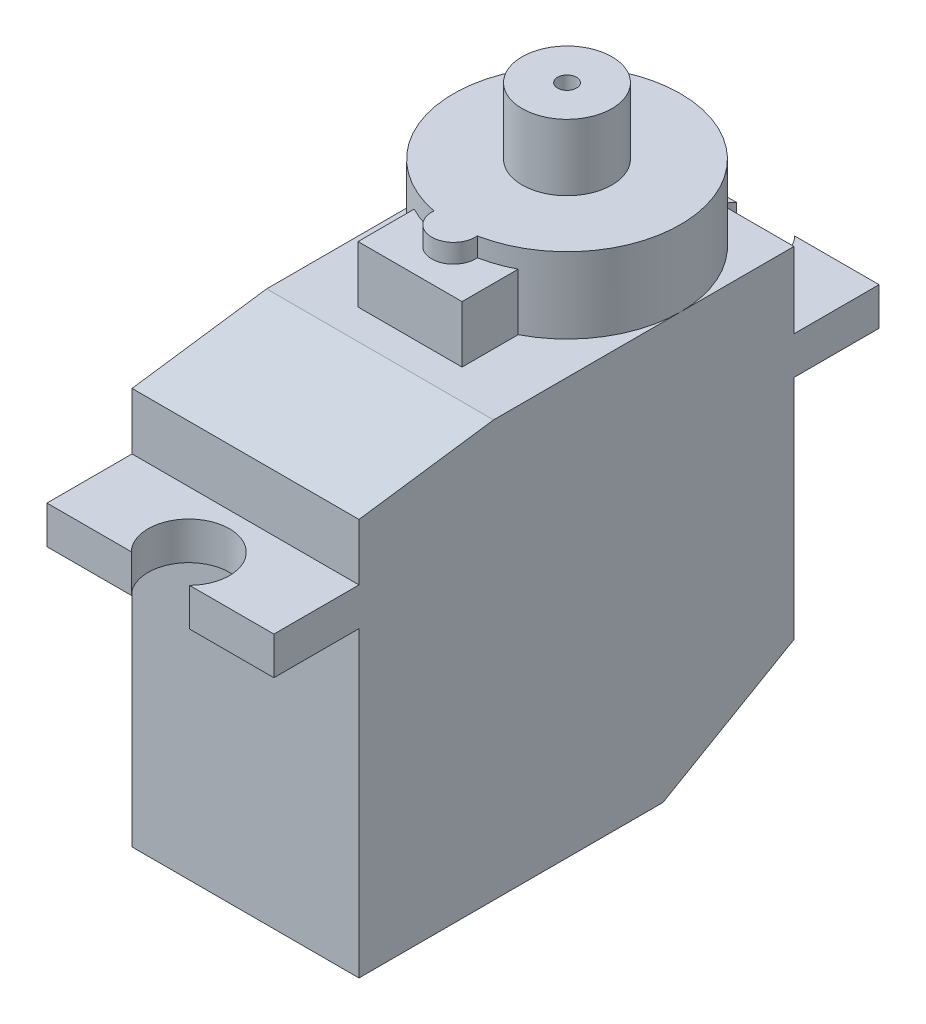
ISO-10303-21;
HEADER;
FILE_DESCRIPTION(('STEP AP214'),'2;1');
FILE_NAME('part.step','',(''),(''),'','','');
FILE_SCHEMA(('AUTOMOTIVE_DESIGN { 1 0 10303 214 1 1 1 1 }'));
ENDSEC;
DATA;
#1=APPLICATION_CONTEXT('core data for automotive mechanical design processes');
#2=APPLICATION_PROTOCOL_DEFINITION('international standard','automotive_design',2000,#1);
#3=PRODUCT_CONTEXT('',#1,'mechanical');
#4=PRODUCT('Part','Part','',(#3));
#5=PRODUCT_RELATED_PRODUCT_CATEGORY('part','',(#4));
#6=PRODUCT_DEFINITION_FORMATION('','',#4);
#7=PRODUCT_DEFINITION_CONTEXT('part definition',#1,'design');
#8=PRODUCT_DEFINITION('design','',#6,#7);
#9=PRODUCT_DEFINITION_SHAPE('','',#8);
#10=(LENGTH_UNIT() NAMED_UNIT(*) SI_UNIT(.MILLI.,.METRE.));
#11=(NAMED_UNIT(*) PLANE_ANGLE_UNIT() SI_UNIT($,.RADIAN.));
#12=(NAMED_UNIT(*) SI_UNIT($,.STERADIAN.) SOLID_ANGLE_UNIT());
#13=UNCERTAINTY_MEASURE_WITH_UNIT(LENGTH_MEASURE(1.E-05),#10,'distance_accuracy_value','');
#14=(GEOMETRIC_REPRESENTATION_CONTEXT(3) GLOBAL_UNCERTAINTY_ASSIGNED_CONTEXT((#13)) GLOBAL_UNIT_ASSIGNED_CONTEXT((#10,
#11,#12)) REPRESENTATION_CONTEXT('',''));
#15=CARTESIAN_POINT('',(0.,0.,0.));
#16=DIRECTION('',(0.,0.,1.));
#17=DIRECTION('',(1.,0.,0.));
#18=AXIS2_PLACEMENT_3D('',#15,#16,#17);
#19=CARTESIAN_POINT('',(0.,26.,0.));
#20=DIRECTION('',(0.,1.,0.));
#21=DIRECTION('',(0.,0.,1.));
#22=AXIS2_PLACEMENT_3D('',#19,#20,#21);
#23=PLANE('',#22);
#24=CARTESIAN_POINT('',(0.,26.,0.));
#25=DIRECTION('',(0.,1.,0.));
#26=DIRECTION('',(0.,0.,1.));
#27=AXIS2_PLACEMENT_3D('',#24,#25,#26);
#28=CIRCLE('',#27,6.);
#29=CARTESIAN_POINT('',(1.14470700323877,26.,5.88979166666666));
#30=VERTEX_POINT('',#29);
#31=CARTESIAN_POINT('',(-1.14470700323877,26.,5.88979166666666));
#32=VERTEX_POINT('',#31);
#33=EDGE_CURVE('E218',#30,#32,#28,.T.);
#34=ORIENTED_EDGE('',*,*,#33,.T.);
#35=CARTESIAN_POINT('',(0.,26.,6.));
#36=DIRECTION('',(0.,1.,0.));
#37=DIRECTION('',(0.,0.,1.));
#38=AXIS2_PLACEMENT_3D('',#35,#36,#37);
#39=CIRCLE('',#38,1.15);
#40=EDGE_CURVE('E223',#32,#30,#39,.T.);
#41=ORIENTED_EDGE('',*,*,#40,.T.);
#42=EDGE_LOOP('',(#34,#41));
#43=FACE_BOUND('',#42,.T.);
#44=CARTESIAN_POINT('',(0.,26.,0.));
#45=DIRECTION('',(0.,1.,0.));
#46=DIRECTION('',(0.,0.,1.));
#47=AXIS2_PLACEMENT_3D('',#44,#45,#46);
#48=CIRCLE('',#47,2.375);
#49=CARTESIAN_POINT('',(0.,26.,2.375));
#50=VERTEX_POINT('',#49);
#51=EDGE_CURVE('E345',#50,#50,#48,.T.);
#52=ORIENTED_EDGE('',*,*,#51,.F.);
#53=EDGE_LOOP('',(#52));
#54=FACE_BOUND('',#53,.T.);
#55=ADVANCED_FACE('F34',(#43,#54),#23,.T.);
#56=CARTESIAN_POINT('',(0.,26.,0.));
#57=DIRECTION('',(0.,-1.,0.));
#58=DIRECTION('',(0.,0.,-1.));
#59=AXIS2_PLACEMENT_3D('',#56,#57,#58);
#60=CYLINDRICAL_SURFACE('',#59,6.);
#61=DIRECTION('',(0.,-1.,0.));
#62=VECTOR('',#61,1.);
#63=CARTESIAN_POINT('',(-1.14470700323877,25.5,5.88979166666666));
#64=LINE('',#63,#62);
#65=CARTESIAN_POINT('',(-1.14470700323877,25.,5.88979166666666));
#66=VERTEX_POINT('',#65);
#67=EDGE_CURVE('E222',#32,#66,#64,.T.);
#68=ORIENTED_EDGE('',*,*,#67,.F.);
#69=ORIENTED_EDGE('',*,*,#33,.F.);
#70=DIRECTION('',(0.,-1.,0.));
#71=VECTOR('',#70,1.);
#72=CARTESIAN_POINT('',(1.14470700323877,25.5,5.88979166666666));
#73=LINE('',#72,#71);
#74=CARTESIAN_POINT('',(1.14470700323877,25.,5.88979166666666));
#75=VERTEX_POINT('',#74);
#76=EDGE_CURVE('E215',#75,#30,#73,.F.);
#77=ORIENTED_EDGE('',*,*,#76,.F.);
#78=CARTESIAN_POINT('',(0.,25.,0.));
#79=DIRECTION('',(0.,-1.,0.));
#80=DIRECTION('',(0.,0.,-1.));
#81=AXIS2_PLACEMENT_3D('',#78,#79,#80);
#82=CIRCLE('',#81,6.);
#83=CARTESIAN_POINT('',(2.75,25.,5.33268225192538));
#84=VERTEX_POINT('',#83);
#85=EDGE_CURVE('E201',#84,#75,#82,.T.);
#86=ORIENTED_EDGE('',*,*,#85,.F.);
#87=DIRECTION('',(0.,-1.,0.));
#88=VECTOR('',#87,1.);
#89=CARTESIAN_POINT('',(2.75,26.,5.33268225192538));
#90=LINE('',#89,#88);
#91=CARTESIAN_POINT('',(2.75,22.,5.33268225192538));
#92=VERTEX_POINT('',#91);
#93=EDGE_CURVE('E211',#92,#84,#90,.F.);
#94=ORIENTED_EDGE('',*,*,#93,.F.);
#95=CARTESIAN_POINT('',(0.,22.,0.));
#96=DIRECTION('',(0.,1.,0.));
#97=DIRECTION('',(0.,0.,1.));
#98=AXIS2_PLACEMENT_3D('',#95,#96,#97);
#99=CIRCLE('',#98,6.);
#100=CARTESIAN_POINT('',(6.,22.,0.));
#101=VERTEX_POINT('',#100);
#102=EDGE_CURVE('E303',#92,#101,#99,.T.);
#103=ORIENTED_EDGE('',*,*,#102,.T.);
#104=CARTESIAN_POINT('',(0.,22.,-6.));
#105=VERTEX_POINT('',#104);
#106=EDGE_CURVE('E314',#101,#105,#99,.T.);
#107=ORIENTED_EDGE('',*,*,#106,.T.);
#108=CARTESIAN_POINT('',(-6.,22.,0.));
#109=VERTEX_POINT('',#108);
#110=EDGE_CURVE('E313',#105,#109,#99,.T.);
#111=ORIENTED_EDGE('',*,*,#110,.T.);
#112=CARTESIAN_POINT('',(-2.75,22.,5.33268225192538));
#113=VERTEX_POINT('',#112);
#114=EDGE_CURVE('E310',#109,#113,#99,.T.);
#115=ORIENTED_EDGE('',*,*,#114,.T.);
#116=DIRECTION('',(0.,-1.,0.));
#117=VECTOR('',#116,1.);
#118=CARTESIAN_POINT('',(-2.75,26.,5.33268225192538));
#119=LINE('',#118,#117);
#120=CARTESIAN_POINT('',(-2.75,25.,5.33268225192538));
#121=VERTEX_POINT('',#120);
#122=EDGE_CURVE('E228',#121,#113,#119,.T.);
#123=ORIENTED_EDGE('',*,*,#122,.F.);
#124=EDGE_CURVE('E212',#66,#121,#82,.T.);
#125=ORIENTED_EDGE('',*,*,#124,.F.);
#126=EDGE_LOOP('',(#68,#69,#77,#86,#94,#103,#107,#111,#115,#123,#125));
#127=FACE_BOUND('',#126,.T.);
#128=ADVANCED_FACE('F216',(#127),#60,.T.);
#129=CARTESIAN_POINT('',(-2.75,25.,0.));
#130=DIRECTION('',(0.,-1.,0.));
#131=DIRECTION('',(0.,0.,-1.));
#132=AXIS2_PLACEMENT_3D('',#129,#130,#131);
#133=PLANE('',#132);
#134=CARTESIAN_POINT('',(0.,25.,6.));
#135=DIRECTION('',(0.,-1.,0.));
#136=DIRECTION('',(0.,0.,-1.));
#137=AXIS2_PLACEMENT_3D('',#134,#135,#136);
#138=CIRCLE('',#137,1.15);
#139=EDGE_CURVE('E205',#66,#75,#138,.F.);
#140=ORIENTED_EDGE('',*,*,#139,.F.);
#141=ORIENTED_EDGE('',*,*,#124,.T.);
#142=DIRECTION('',(0.,0.,1.));
#143=VECTOR('',#142,1.);
#144=CARTESIAN_POINT('',(-2.75,25.,8.3));
#145=LINE('',#144,#143);
#146=CARTESIAN_POINT('',(-2.75,25.,8.3));
#147=VERTEX_POINT('',#146);
#148=EDGE_CURVE('E332',#121,#147,#145,.T.);
#149=ORIENTED_EDGE('',*,*,#148,.T.);
#150=DIRECTION('',(1.,0.,0.));
#151=VECTOR('',#150,1.);
#152=CARTESIAN_POINT('',(-2.75,25.,8.3));
#153=LINE('',#152,#151);
#154=CARTESIAN_POINT('',(2.75,25.,8.3));
#155=VERTEX_POINT('',#154);
#156=EDGE_CURVE('E339',#147,#155,#153,.T.);
#157=ORIENTED_EDGE('',*,*,#156,.T.);
#158=DIRECTION('',(0.,0.,-1.));
#159=VECTOR('',#158,1.);
#160=CARTESIAN_POINT('',(2.75,25.,8.3));
#161=LINE('',#160,#159);
#162=EDGE_CURVE('E208',#155,#84,#161,.T.);
#163=ORIENTED_EDGE('',*,*,#162,.T.);
#164=ORIENTED_EDGE('',*,*,#85,.T.);
#165=EDGE_LOOP('',(#140,#141,#149,#157,#163,#164));
#166=FACE_BOUND('',#165,.T.);
#167=ADVANCED_FACE('F203',(#166),#133,.F.);
#168=CARTESIAN_POINT('',(-6.,22.,17.));
#169=DIRECTION('',(0.,1.,0.));
#170=DIRECTION('',(0.,0.,1.));
#171=AXIS2_PLACEMENT_3D('',#168,#169,#170);
#172=PLANE('',#171);
#173=DIRECTION('',(0.,0.,1.));
#174=VECTOR('',#173,1.);
#175=CARTESIAN_POINT('',(-6.,22.,-6.));
#176=LINE('',#175,#174);
#177=CARTESIAN_POINT('',(-6.,22.,9.88463027761568));
#178=VERTEX_POINT('',#177);
#179=EDGE_CURVE('E649',#109,#178,#176,.T.);
#180=ORIENTED_EDGE('',*,*,#179,.T.);
#181=DIRECTION('',(1.,0.,0.));
#182=VECTOR('',#181,1.);
#183=CARTESIAN_POINT('',(6.,22.,9.88463027761579));
#184=LINE('',#183,#182);
#185=CARTESIAN_POINT('',(6.,22.,9.88463027761568));
#186=VERTEX_POINT('',#185);
#187=EDGE_CURVE('E231',#178,#186,#184,.T.);
#188=ORIENTED_EDGE('',*,*,#187,.T.);
#189=DIRECTION('',(0.,0.,-1.));
#190=VECTOR('',#189,1.);
#191=CARTESIAN_POINT('',(6.,22.,-6.));
#192=LINE('',#191,#190);
#193=EDGE_CURVE('E309',#186,#101,#192,.T.);
#194=ORIENTED_EDGE('',*,*,#193,.T.);
#195=ORIENTED_EDGE('',*,*,#102,.F.);
#196=DIRECTION('',(0.,0.,-1.));
#197=VECTOR('',#196,1.);
#198=CARTESIAN_POINT('',(2.75,22.,8.3));
#199=LINE('',#198,#197);
#200=CARTESIAN_POINT('',(2.75,22.,8.3));
#201=VERTEX_POINT('',#200);
#202=EDGE_CURVE('E299',#201,#92,#199,.T.);
#203=ORIENTED_EDGE('',*,*,#202,.F.);
#204=DIRECTION('',(1.,0.,0.));
#205=VECTOR('',#204,1.);
#206=CARTESIAN_POINT('',(-2.75,22.,8.3));
#207=LINE('',#206,#205);
#208=CARTESIAN_POINT('',(-2.75,22.,8.3));
#209=VERTEX_POINT('',#208);
#210=EDGE_CURVE('E333',#209,#201,#207,.T.);
#211=ORIENTED_EDGE('',*,*,#210,.F.);
#212=DIRECTION('',(0.,0.,1.));
#213=VECTOR('',#212,1.);
#214=CARTESIAN_POINT('',(-2.75,22.,8.3));
#215=LINE('',#214,#213);
#216=EDGE_CURVE('E335',#113,#209,#215,.T.);
#217=ORIENTED_EDGE('',*,*,#216,.F.);
#218=ORIENTED_EDGE('',*,*,#114,.F.);
#219=EDGE_LOOP('',(#180,#188,#194,#195,#203,#211,#217,#218));
#220=FACE_BOUND('',#219,.T.);
#221=ADVANCED_FACE('F307',(#220),#172,.T.);
#222=ORIENTED_EDGE('',*,*,#106,.F.);
#223=CARTESIAN_POINT('',(6.,22.,-6.));
#224=VERTEX_POINT('',#223);
#225=EDGE_CURVE('E651',#101,#224,#192,.T.);
#226=ORIENTED_EDGE('',*,*,#225,.T.);
#227=DIRECTION('',(-1.,0.,0.));
#228=VECTOR('',#227,1.);
#229=CARTESIAN_POINT('',(-6.,22.,-6.));
#230=LINE('',#229,#228);
#231=EDGE_CURVE('E654',#224,#105,#230,.T.);
#232=ORIENTED_EDGE('',*,*,#231,.T.);
#233=EDGE_LOOP('',(#222,#226,#232));
#234=FACE_BOUND('',#233,.T.);
#235=ADVANCED_FACE('F483',(#234),#172,.T.);
#236=ORIENTED_EDGE('',*,*,#110,.F.);
#237=CARTESIAN_POINT('',(-6.,22.,-6.));
#238=VERTEX_POINT('',#237);
#239=EDGE_CURVE('E652',#105,#238,#230,.T.);
#240=ORIENTED_EDGE('',*,*,#239,.T.);
#241=EDGE_CURVE('E656',#238,#109,#176,.T.);
#242=ORIENTED_EDGE('',*,*,#241,.T.);
#243=EDGE_LOOP('',(#236,#240,#242));
#244=FACE_BOUND('',#243,.T.);
#245=ADVANCED_FACE('F478',(#244),#172,.T.);
#246=CARTESIAN_POINT('',(-6.,22.,17.));
#247=DIRECTION('',(0.,0.,-1.));
#248=DIRECTION('',(-1.,0.,0.));
#249=AXIS2_PLACEMENT_3D('',#246,#247,#248);
#250=PLANE('',#249);
#251=DIRECTION('',(0.,-1.,0.));
#252=VECTOR('',#251,1.);
#253=CARTESIAN_POINT('',(6.,22.,17.));
#254=LINE('',#253,#252);
#255=CARTESIAN_POINT('',(6.,21.,17.));
#256=VERTEX_POINT('',#255);
#257=CARTESIAN_POINT('',(6.,18.,17.));
#258=VERTEX_POINT('',#257);
#259=EDGE_CURVE('E239',#256,#258,#254,.T.);
#260=ORIENTED_EDGE('',*,*,#259,.F.);
#261=DIRECTION('',(-1.,0.,0.));
#262=VECTOR('',#261,1.);
#263=CARTESIAN_POINT('',(-6.,21.,17.));
#264=LINE('',#263,#262);
#265=CARTESIAN_POINT('',(-6.,21.,17.));
#266=VERTEX_POINT('',#265);
#267=EDGE_CURVE('E42',#256,#266,#264,.T.);
#268=ORIENTED_EDGE('',*,*,#267,.T.);
#269=DIRECTION('',(0.,-1.,0.));
#270=VECTOR('',#269,1.);
#271=CARTESIAN_POINT('',(-6.,22.,17.));
#272=LINE('',#271,#270);
#273=CARTESIAN_POINT('',(-6.,18.,17.));
#274=VERTEX_POINT('',#273);
#275=EDGE_CURVE('E260',#266,#274,#272,.T.);
#276=ORIENTED_EDGE('',*,*,#275,.T.);
#277=DIRECTION('',(-1.,0.,0.));
#278=VECTOR('',#277,1.);
#279=CARTESIAN_POINT('',(-6.,18.,17.));
#280=LINE('',#279,#278);
#281=EDGE_CURVE('E261',#258,#274,#280,.T.);
#282=ORIENTED_EDGE('',*,*,#281,.F.);
#283=EDGE_LOOP('',(#260,#268,#276,#282));
#284=FACE_BOUND('',#283,.T.);
#285=ADVANCED_FACE('F467',(#284),#250,.F.);
#286=CARTESIAN_POINT('',(-6.,22.,-6.));
#287=DIRECTION('',(0.,0.,1.));
#288=DIRECTION('',(1.,0.,0.));
#289=AXIS2_PLACEMENT_3D('',#286,#287,#288);
#290=PLANE('',#289);
#291=DIRECTION('',(1.,0.,0.));
#292=VECTOR('',#291,1.);
#293=CARTESIAN_POINT('',(-6.,18.,-6.));
#294=LINE('',#293,#292);
#295=CARTESIAN_POINT('',(-6.,18.,-6.));
#296=VERTEX_POINT('',#295);
#297=CARTESIAN_POINT('',(6.,18.,-6.));
#298=VERTEX_POINT('',#297);
#299=EDGE_CURVE('E730',#296,#298,#294,.T.);
#300=ORIENTED_EDGE('',*,*,#299,.F.);
#301=DIRECTION('',(0.,-1.,0.));
#302=VECTOR('',#301,1.);
#303=CARTESIAN_POINT('',(-6.,22.,-6.));
#304=LINE('',#303,#302);
#305=EDGE_CURVE('E676',#238,#296,#304,.T.);
#306=ORIENTED_EDGE('',*,*,#305,.F.);
#307=ORIENTED_EDGE('',*,*,#239,.F.);
#308=ORIENTED_EDGE('',*,*,#231,.F.);
#309=DIRECTION('',(0.,-1.,0.));
#310=VECTOR('',#309,1.);
#311=CARTESIAN_POINT('',(6.,22.,-6.));
#312=LINE('',#311,#310);
#313=EDGE_CURVE('E256',#224,#298,#312,.T.);
#314=ORIENTED_EDGE('',*,*,#313,.T.);
#315=EDGE_LOOP('',(#300,#306,#307,#308,#314));
#316=FACE_BOUND('',#315,.T.);
#317=ADVANCED_FACE('F461',(#316),#290,.F.);
#318=CARTESIAN_POINT('',(-6.,22.,-6.));
#319=DIRECTION('',(1.,0.,0.));
#320=DIRECTION('',(0.,0.,-1.));
#321=AXIS2_PLACEMENT_3D('',#318,#319,#320);
#322=PLANE('',#321);
#323=ORIENTED_EDGE('',*,*,#275,.F.);
#324=DIRECTION('',(0.,0.139173100960066,-0.99026806874157));
#325=VECTOR('',#324,1.);
#326=CARTESIAN_POINT('',(-6.,22.,9.88463027761579));
#327=LINE('',#326,#325);
#328=EDGE_CURVE('E11',#266,#178,#327,.T.);
#329=ORIENTED_EDGE('',*,*,#328,.T.);
#330=ORIENTED_EDGE('',*,*,#179,.F.);
#331=ORIENTED_EDGE('',*,*,#241,.F.);
#332=ORIENTED_EDGE('',*,*,#305,.T.);
#333=DIRECTION('',(0.,0.,1.));
#334=VECTOR('',#333,1.);
#335=CARTESIAN_POINT('',(-6.,18.,-6.));
#336=LINE('',#335,#334);
#337=CARTESIAN_POINT('',(-6.,18.,-10.5));
#338=VERTEX_POINT('',#337);
#339=EDGE_CURVE('E737',#338,#296,#336,.T.);
#340=ORIENTED_EDGE('',*,*,#339,.F.);
#341=DIRECTION('',(0.,-1.,0.));
#342=VECTOR('',#341,1.);
#343=CARTESIAN_POINT('',(-6.,18.,-10.5));
#344=LINE('',#343,#342);
#345=CARTESIAN_POINT('',(-6.,16.,-10.5));
#346=VERTEX_POINT('',#345);
#347=EDGE_CURVE('E740',#338,#346,#344,.T.);
#348=ORIENTED_EDGE('',*,*,#347,.T.);
#349=DIRECTION('',(0.,0.,1.));
#350=VECTOR('',#349,1.);
#351=CARTESIAN_POINT('',(-6.,16.,-6.));
#352=LINE('',#351,#350);
#353=CARTESIAN_POINT('',(-6.,16.,-6.));
#354=VERTEX_POINT('',#353);
#355=EDGE_CURVE('E735',#346,#354,#352,.T.);
#356=ORIENTED_EDGE('',*,*,#355,.T.);
#357=CARTESIAN_POINT('',(-6.,4.00000000000001,-6.));
#358=VERTEX_POINT('',#357);
#359=EDGE_CURVE('E661',#354,#358,#304,.T.);
#360=ORIENTED_EDGE('',*,*,#359,.T.);
#361=DIRECTION('',(0.,0.500000000000001,-0.866025403784438));
#362=VECTOR('',#361,1.);
#363=CARTESIAN_POINT('',(-6.,4.00000000000001,-6.));
#364=LINE('',#363,#362);
#365=CARTESIAN_POINT('',(-6.,0.,0.928203230275506));
#366=VERTEX_POINT('',#365);
#367=EDGE_CURVE('E683',#358,#366,#364,.F.);
#368=ORIENTED_EDGE('',*,*,#367,.T.);
#369=DIRECTION('',(0.,0.,1.));
#370=VECTOR('',#369,1.);
#371=CARTESIAN_POINT('',(-6.,0.,-6.));
#372=LINE('',#371,#370);
#373=CARTESIAN_POINT('',(-6.,0.,17.));
#374=VERTEX_POINT('',#373);
#375=EDGE_CURVE('E662',#366,#374,#372,.T.);
#376=ORIENTED_EDGE('',*,*,#375,.T.);
#377=CARTESIAN_POINT('',(-6.,16.,17.));
#378=VERTEX_POINT('',#377);
#379=EDGE_CURVE('E242',#378,#374,#272,.T.);
#380=ORIENTED_EDGE('',*,*,#379,.F.);
#381=DIRECTION('',(0.,0.,1.));
#382=VECTOR('',#381,1.);
#383=CARTESIAN_POINT('',(-6.,16.,17.));
#384=LINE('',#383,#382);
#385=CARTESIAN_POINT('',(-5.99999999999999,16.,21.5));
#386=VERTEX_POINT('',#385);
#387=EDGE_CURVE('E290',#378,#386,#384,.T.);
#388=ORIENTED_EDGE('',*,*,#387,.T.);
#389=DIRECTION('',(0.,-1.,0.));
#390=VECTOR('',#389,1.);
#391=CARTESIAN_POINT('',(-5.99999999999999,18.,21.5));
#392=LINE('',#391,#390);
#393=CARTESIAN_POINT('',(-5.99999999999999,18.,21.5));
#394=VERTEX_POINT('',#393);
#395=EDGE_CURVE('E721',#394,#386,#392,.T.);
#396=ORIENTED_EDGE('',*,*,#395,.F.);
#397=DIRECTION('',(0.,0.,1.));
#398=VECTOR('',#397,1.);
#399=CARTESIAN_POINT('',(-6.,18.,17.));
#400=LINE('',#399,#398);
#401=EDGE_CURVE('E265',#274,#394,#400,.T.);
#402=ORIENTED_EDGE('',*,*,#401,.F.);
#403=EDGE_LOOP('',(#323,#329,#330,#331,#332,#340,#348,#356,#360,#368,#376,#380,#388,#396,#402));
#404=FACE_BOUND('',#403,.T.);
#405=ADVANCED_FACE('F466',(#404),#322,.F.);
#406=CARTESIAN_POINT('',(6.,16.,17.));
#407=VERTEX_POINT('',#406);
#408=CARTESIAN_POINT('',(6.,0.,17.));
#409=VERTEX_POINT('',#408);
#410=EDGE_CURVE('E243',#407,#409,#254,.T.);
#411=ORIENTED_EDGE('',*,*,#410,.F.);
#412=DIRECTION('',(-1.,0.,0.));
#413=VECTOR('',#412,1.);
#414=CARTESIAN_POINT('',(-6.,16.,17.));
#415=LINE('',#414,#413);
#416=EDGE_CURVE('E287',#407,#378,#415,.T.);
#417=ORIENTED_EDGE('',*,*,#416,.T.);
#418=ORIENTED_EDGE('',*,*,#379,.T.);
#419=DIRECTION('',(1.,0.,0.));
#420=VECTOR('',#419,1.);
#421=CARTESIAN_POINT('',(-6.,0.,17.));
#422=LINE('',#421,#420);
#423=EDGE_CURVE('E665',#374,#409,#422,.T.);
#424=ORIENTED_EDGE('',*,*,#423,.T.);
#425=EDGE_LOOP('',(#411,#417,#418,#424));
#426=FACE_BOUND('',#425,.T.);
#427=ADVANCED_FACE('F613',(#426),#250,.F.);
#428=CARTESIAN_POINT('',(6.,22.,-6.));
#429=DIRECTION('',(-1.,0.,0.));
#430=DIRECTION('',(0.,0.,1.));
#431=AXIS2_PLACEMENT_3D('',#428,#429,#430);
#432=PLANE('',#431);
#433=ORIENTED_EDGE('',*,*,#193,.F.);
#434=DIRECTION('',(0.,-0.139173100960066,0.99026806874157));
#435=VECTOR('',#434,1.);
#436=CARTESIAN_POINT('',(6.,22.,9.88463027761579));
#437=LINE('',#436,#435);
#438=EDGE_CURVE('E56',#186,#256,#437,.T.);
#439=ORIENTED_EDGE('',*,*,#438,.T.);
#440=ORIENTED_EDGE('',*,*,#259,.T.);
#441=DIRECTION('',(0.,0.,-1.));
#442=VECTOR('',#441,1.);
#443=CARTESIAN_POINT('',(6.,18.,17.));
#444=LINE('',#443,#442);
#445=CARTESIAN_POINT('',(6.,18.,21.5));
#446=VERTEX_POINT('',#445);
#447=EDGE_CURVE('E266',#446,#258,#444,.T.);
#448=ORIENTED_EDGE('',*,*,#447,.F.);
#449=DIRECTION('',(0.,-1.,0.));
#450=VECTOR('',#449,1.);
#451=CARTESIAN_POINT('',(6.,18.,21.5));
#452=LINE('',#451,#450);
#453=CARTESIAN_POINT('',(6.,16.,21.5));
#454=VERTEX_POINT('',#453);
#455=EDGE_CURVE('E715',#446,#454,#452,.T.);
#456=ORIENTED_EDGE('',*,*,#455,.T.);
#457=DIRECTION('',(0.,0.,-1.));
#458=VECTOR('',#457,1.);
#459=CARTESIAN_POINT('',(6.,16.,17.));
#460=LINE('',#459,#458);
#461=EDGE_CURVE('E281',#454,#407,#460,.T.);
#462=ORIENTED_EDGE('',*,*,#461,.T.);
#463=ORIENTED_EDGE('',*,*,#410,.T.);
#464=DIRECTION('',(0.,0.,-1.));
#465=VECTOR('',#464,1.);
#466=CARTESIAN_POINT('',(6.,0.,-6.));
#467=LINE('',#466,#465);
#468=CARTESIAN_POINT('',(6.,0.,0.928203230275504));
#469=VERTEX_POINT('',#468);
#470=EDGE_CURVE('E669',#409,#469,#467,.T.);
#471=ORIENTED_EDGE('',*,*,#470,.T.);
#472=DIRECTION('',(0.,-0.500000000000001,0.866025403784438));
#473=VECTOR('',#472,1.);
#474=CARTESIAN_POINT('',(6.,4.00000000000001,-6.));
#475=LINE('',#474,#473);
#476=CARTESIAN_POINT('',(6.,4.00000000000001,-6.));
#477=VERTEX_POINT('',#476);
#478=EDGE_CURVE('E311',#469,#477,#475,.F.);
#479=ORIENTED_EDGE('',*,*,#478,.T.);
#480=CARTESIAN_POINT('',(6.,16.,-6.));
#481=VERTEX_POINT('',#480);
#482=EDGE_CURVE('E679',#481,#477,#312,.T.);
#483=ORIENTED_EDGE('',*,*,#482,.F.);
#484=DIRECTION('',(0.,0.,-1.));
#485=VECTOR('',#484,1.);
#486=CARTESIAN_POINT('',(6.,16.,-6.));
#487=LINE('',#486,#485);
#488=CARTESIAN_POINT('',(6.,16.,-10.5));
#489=VERTEX_POINT('',#488);
#490=EDGE_CURVE('E749',#481,#489,#487,.T.);
#491=ORIENTED_EDGE('',*,*,#490,.T.);
#492=DIRECTION('',(0.,-1.,0.));
#493=VECTOR('',#492,1.);
#494=CARTESIAN_POINT('',(6.,18.,-10.5));
#495=LINE('',#494,#493);
#496=CARTESIAN_POINT('',(6.,18.,-10.5));
#497=VERTEX_POINT('',#496);
#498=EDGE_CURVE('E666',#497,#489,#495,.T.);
#499=ORIENTED_EDGE('',*,*,#498,.F.);
#500=DIRECTION('',(0.,0.,-1.));
#501=VECTOR('',#500,1.);
#502=CARTESIAN_POINT('',(6.,18.,-6.));
#503=LINE('',#502,#501);
#504=EDGE_CURVE('E734',#298,#497,#503,.T.);
#505=ORIENTED_EDGE('',*,*,#504,.F.);
#506=ORIENTED_EDGE('',*,*,#313,.F.);
#507=ORIENTED_EDGE('',*,*,#225,.F.);
#508=EDGE_LOOP('',(#433,#439,#440,#448,#456,#462,#463,#471,#479,#483,#491,#499,#505,#506,#507));
#509=FACE_BOUND('',#508,.T.);
#510=ADVANCED_FACE('F604',(#509),#432,.F.);
#511=ORIENTED_EDGE('',*,*,#359,.F.);
#512=DIRECTION('',(1.,0.,0.));
#513=VECTOR('',#512,1.);
#514=CARTESIAN_POINT('',(-6.,16.,-6.));
#515=LINE('',#514,#513);
#516=EDGE_CURVE('E718',#354,#481,#515,.T.);
#517=ORIENTED_EDGE('',*,*,#516,.T.);
#518=ORIENTED_EDGE('',*,*,#482,.T.);
#519=DIRECTION('',(-1.,0.,0.));
#520=VECTOR('',#519,1.);
#521=CARTESIAN_POINT('',(-6.,4.00000000000001,-6.));
#522=LINE('',#521,#520);
#523=EDGE_CURVE('E647',#477,#358,#522,.T.);
#524=ORIENTED_EDGE('',*,*,#523,.T.);
#525=EDGE_LOOP('',(#511,#517,#518,#524));
#526=FACE_BOUND('',#525,.T.);
#527=ADVANCED_FACE('F470',(#526),#290,.F.);
#528=CARTESIAN_POINT('',(-6.,0.,17.));
#529=DIRECTION('',(0.,1.,0.));
#530=DIRECTION('',(0.,0.,1.));
#531=AXIS2_PLACEMENT_3D('',#528,#529,#530);
#532=PLANE('',#531);
#533=ORIENTED_EDGE('',*,*,#375,.F.);
#534=DIRECTION('',(1.,0.,0.));
#535=VECTOR('',#534,1.);
#536=CARTESIAN_POINT('',(-6.,0.,0.928203230275506));
#537=LINE('',#536,#535);
#538=EDGE_CURVE('E317',#366,#469,#537,.T.);
#539=ORIENTED_EDGE('',*,*,#538,.T.);
#540=ORIENTED_EDGE('',*,*,#470,.F.);
#541=ORIENTED_EDGE('',*,*,#423,.F.);
#542=EDGE_LOOP('',(#533,#539,#540,#541));
#543=FACE_BOUND('',#542,.T.);
#544=ADVANCED_FACE('F603',(#543),#532,.F.);
#545=CARTESIAN_POINT('',(-6.,4.00000000000001,-6.));
#546=DIRECTION('',(0.,0.866025403784438,0.500000000000001));
#547=DIRECTION('',(0.,-0.500000000000001,0.866025403784438));
#548=AXIS2_PLACEMENT_3D('',#545,#546,#547);
#549=PLANE('',#548);
#550=ORIENTED_EDGE('',*,*,#478,.F.);
#551=ORIENTED_EDGE('',*,*,#538,.F.);
#552=ORIENTED_EDGE('',*,*,#367,.F.);
#553=ORIENTED_EDGE('',*,*,#523,.F.);
#554=EDGE_LOOP('',(#550,#551,#552,#553));
#555=FACE_BOUND('',#554,.T.);
#556=ADVANCED_FACE('F591',(#555),#549,.F.);
#557=CARTESIAN_POINT('',(6.,18.,-10.5));
#558=DIRECTION('',(0.,0.,1.));
#559=DIRECTION('',(1.,0.,0.));
#560=AXIS2_PLACEMENT_3D('',#557,#558,#559);
#561=PLANE('',#560);
#562=DIRECTION('',(-1.,0.,0.));
#563=VECTOR('',#562,1.);
#564=CARTESIAN_POINT('',(6.,16.,-10.5));
#565=LINE('',#564,#563);
#566=CARTESIAN_POINT('',(1.54029218007494,16.,-10.5));
#567=VERTEX_POINT('',#566);
#568=EDGE_CURVE('E753',#489,#567,#565,.T.);
#569=ORIENTED_EDGE('',*,*,#568,.T.);
#570=DIRECTION('',(0.,-1.,0.));
#571=VECTOR('',#570,1.);
#572=CARTESIAN_POINT('',(1.54029218007494,18.,-10.5));
#573=LINE('',#572,#571);
#574=CARTESIAN_POINT('',(1.54029218007494,18.,-10.5));
#575=VERTEX_POINT('',#574);
#576=EDGE_CURVE('E763',#575,#567,#573,.T.);
#577=ORIENTED_EDGE('',*,*,#576,.F.);
#578=DIRECTION('',(-1.,0.,0.));
#579=VECTOR('',#578,1.);
#580=CARTESIAN_POINT('',(6.,18.,-10.5));
#581=LINE('',#580,#579);
#582=EDGE_CURVE('E727',#497,#575,#581,.T.);
#583=ORIENTED_EDGE('',*,*,#582,.F.);
#584=ORIENTED_EDGE('',*,*,#498,.T.);
#585=EDGE_LOOP('',(#569,#577,#583,#584));
#586=FACE_BOUND('',#585,.T.);
#587=ADVANCED_FACE('F581',(#586),#561,.F.);
#588=CARTESIAN_POINT('',(0.,18.,-9.));
#589=DIRECTION('',(0.,-1.,0.));
#590=DIRECTION('',(0.,0.,-1.));
#591=AXIS2_PLACEMENT_3D('',#588,#589,#590);
#592=CYLINDRICAL_SURFACE('',#591,2.15);
#593=CARTESIAN_POINT('',(0.,16.,-9.));
#594=DIRECTION('',(0.,-1.,0.));
#595=DIRECTION('',(0.,0.,1.));
#596=AXIS2_PLACEMENT_3D('',#593,#594,#595);
#597=CIRCLE('',#596,2.15);
#598=CARTESIAN_POINT('',(-1.54029218007494,16.,-10.5));
#599=VERTEX_POINT('',#598);
#600=EDGE_CURVE('E755',#567,#599,#597,.T.);
#601=ORIENTED_EDGE('',*,*,#600,.T.);
#602=DIRECTION('',(0.,-1.,0.));
#603=VECTOR('',#602,1.);
#604=CARTESIAN_POINT('',(-1.54029218007494,18.,-10.5));
#605=LINE('',#604,#603);
#606=CARTESIAN_POINT('',(-1.54029218007494,18.,-10.5));
#607=VERTEX_POINT('',#606);
#608=EDGE_CURVE('E760',#607,#599,#605,.T.);
#609=ORIENTED_EDGE('',*,*,#608,.F.);
#610=CARTESIAN_POINT('',(0.,18.,-9.));
#611=DIRECTION('',(0.,-1.,0.));
#612=DIRECTION('',(0.,0.,1.));
#613=AXIS2_PLACEMENT_3D('',#610,#611,#612);
#614=CIRCLE('',#613,2.15);
#615=EDGE_CURVE('E781',#575,#607,#614,.T.);
#616=ORIENTED_EDGE('',*,*,#615,.F.);
#617=ORIENTED_EDGE('',*,*,#576,.T.);
#618=EDGE_LOOP('',(#601,#609,#616,#617));
#619=FACE_BOUND('',#618,.T.);
#620=ADVANCED_FACE('F571',(#619),#592,.F.);
#621=CARTESIAN_POINT('',(-6.,18.,-10.5));
#622=DIRECTION('',(0.,0.,1.));
#623=DIRECTION('',(1.,0.,0.));
#624=AXIS2_PLACEMENT_3D('',#621,#622,#623);
#625=PLANE('',#624);
#626=DIRECTION('',(-1.,0.,0.));
#627=VECTOR('',#626,1.);
#628=CARTESIAN_POINT('',(-6.,16.,-10.5));
#629=LINE('',#628,#627);
#630=EDGE_CURVE('E745',#599,#346,#629,.T.);
#631=ORIENTED_EDGE('',*,*,#630,.T.);
#632=ORIENTED_EDGE('',*,*,#347,.F.);
#633=DIRECTION('',(-1.,0.,0.));
#634=VECTOR('',#633,1.);
#635=CARTESIAN_POINT('',(-6.,18.,-10.5));
#636=LINE('',#635,#634);
#637=EDGE_CURVE('E741',#607,#338,#636,.T.);
#638=ORIENTED_EDGE('',*,*,#637,.F.);
#639=ORIENTED_EDGE('',*,*,#608,.T.);
#640=EDGE_LOOP('',(#631,#632,#638,#639));
#641=FACE_BOUND('',#640,.T.);
#642=ADVANCED_FACE('F561',(#641),#625,.F.);
#643=CARTESIAN_POINT('',(0.,18.,-9.));
#644=DIRECTION('',(0.,1.,0.));
#645=DIRECTION('',(0.,0.,1.));
#646=AXIS2_PLACEMENT_3D('',#643,#644,#645);
#647=PLANE('',#646);
#648=ORIENTED_EDGE('',*,*,#299,.T.);
#649=ORIENTED_EDGE('',*,*,#504,.T.);
#650=ORIENTED_EDGE('',*,*,#582,.T.);
#651=ORIENTED_EDGE('',*,*,#615,.T.);
#652=ORIENTED_EDGE('',*,*,#637,.T.);
#653=ORIENTED_EDGE('',*,*,#339,.T.);
#654=EDGE_LOOP('',(#648,#649,#650,#651,#652,#653));
#655=FACE_BOUND('',#654,.T.);
#656=ADVANCED_FACE('F551',(#655),#647,.T.);
#657=CARTESIAN_POINT('',(0.,16.,-9.));
#658=DIRECTION('',(0.,1.,0.));
#659=DIRECTION('',(0.,0.,1.));
#660=AXIS2_PLACEMENT_3D('',#657,#658,#659);
#661=PLANE('',#660);
#662=ORIENTED_EDGE('',*,*,#516,.F.);
#663=ORIENTED_EDGE('',*,*,#355,.F.);
#664=ORIENTED_EDGE('',*,*,#630,.F.);
#665=ORIENTED_EDGE('',*,*,#600,.F.);
#666=ORIENTED_EDGE('',*,*,#568,.F.);
#667=ORIENTED_EDGE('',*,*,#490,.F.);
#668=EDGE_LOOP('',(#662,#663,#664,#665,#666,#667));
#669=FACE_BOUND('',#668,.T.);
#670=ADVANCED_FACE('F541',(#669),#661,.F.);
#671=CARTESIAN_POINT('',(0.,18.,20.));
#672=DIRECTION('',(0.,-1.,0.));
#673=DIRECTION('',(0.,0.,-1.));
#674=AXIS2_PLACEMENT_3D('',#671,#672,#673);
#675=CYLINDRICAL_SURFACE('',#674,2.15);
#676=CARTESIAN_POINT('',(0.,16.,20.));
#677=DIRECTION('',(0.,-1.,0.));
#678=DIRECTION('',(0.,0.,-1.));
#679=AXIS2_PLACEMENT_3D('',#676,#677,#678);
#680=CIRCLE('',#679,2.15);
#681=CARTESIAN_POINT('',(-1.54029218007493,16.,21.5));
#682=VERTEX_POINT('',#681);
#683=CARTESIAN_POINT('',(1.54029218007494,16.,21.5));
#684=VERTEX_POINT('',#683);
#685=EDGE_CURVE('E276',#682,#684,#680,.T.);
#686=ORIENTED_EDGE('',*,*,#685,.T.);
#687=DIRECTION('',(0.,-1.,0.));
#688=VECTOR('',#687,1.);
#689=CARTESIAN_POINT('',(1.54029218007494,18.,21.5));
#690=LINE('',#689,#688);
#691=CARTESIAN_POINT('',(1.54029218007494,18.,21.5));
#692=VERTEX_POINT('',#691);
#693=EDGE_CURVE('E717',#692,#684,#690,.T.);
#694=ORIENTED_EDGE('',*,*,#693,.F.);
#695=CARTESIAN_POINT('',(0.,18.,20.));
#696=DIRECTION('',(0.,-1.,0.));
#697=DIRECTION('',(0.,0.,-1.));
#698=AXIS2_PLACEMENT_3D('',#695,#696,#697);
#699=CIRCLE('',#698,2.15);
#700=CARTESIAN_POINT('',(-1.54029218007493,18.,21.5));
#701=VERTEX_POINT('',#700);
#702=EDGE_CURVE('E703',#701,#692,#699,.T.);
#703=ORIENTED_EDGE('',*,*,#702,.F.);
#704=DIRECTION('',(0.,-1.,0.));
#705=VECTOR('',#704,1.);
#706=CARTESIAN_POINT('',(-1.54029218007493,18.,21.5));
#707=LINE('',#706,#705);
#708=EDGE_CURVE('E275',#701,#682,#707,.T.);
#709=ORIENTED_EDGE('',*,*,#708,.T.);
#710=EDGE_LOOP('',(#686,#694,#703,#709));
#711=FACE_BOUND('',#710,.T.);
#712=ADVANCED_FACE('F531',(#711),#675,.F.);
#713=CARTESIAN_POINT('',(6.,18.,21.5));
#714=DIRECTION('',(0.,0.,-1.));
#715=DIRECTION('',(-1.,0.,0.));
#716=AXIS2_PLACEMENT_3D('',#713,#714,#715);
#717=PLANE('',#716);
#718=DIRECTION('',(1.,0.,0.));
#719=VECTOR('',#718,1.);
#720=CARTESIAN_POINT('',(6.,16.,21.5));
#721=LINE('',#720,#719);
#722=EDGE_CURVE('E279',#684,#454,#721,.T.);
#723=ORIENTED_EDGE('',*,*,#722,.T.);
#724=ORIENTED_EDGE('',*,*,#455,.F.);
#725=DIRECTION('',(1.,0.,0.));
#726=VECTOR('',#725,1.);
#727=CARTESIAN_POINT('',(6.,18.,21.5));
#728=LINE('',#727,#726);
#729=EDGE_CURVE('E271',#692,#446,#728,.T.);
#730=ORIENTED_EDGE('',*,*,#729,.F.);
#731=ORIENTED_EDGE('',*,*,#693,.T.);
#732=EDGE_LOOP('',(#723,#724,#730,#731));
#733=FACE_BOUND('',#732,.T.);
#734=ADVANCED_FACE('F521',(#733),#717,.F.);
#735=CARTESIAN_POINT('',(-5.99999999999999,18.,21.5));
#736=DIRECTION('',(0.,0.,-1.));
#737=DIRECTION('',(-1.,0.,0.));
#738=AXIS2_PLACEMENT_3D('',#735,#736,#737);
#739=PLANE('',#738);
#740=DIRECTION('',(1.,0.,0.));
#741=VECTOR('',#740,1.);
#742=CARTESIAN_POINT('',(-5.99999999999999,16.,21.5));
#743=LINE('',#742,#741);
#744=EDGE_CURVE('E284',#386,#682,#743,.T.);
#745=ORIENTED_EDGE('',*,*,#744,.T.);
#746=ORIENTED_EDGE('',*,*,#708,.F.);
#747=DIRECTION('',(1.,0.,0.));
#748=VECTOR('',#747,1.);
#749=CARTESIAN_POINT('',(-5.99999999999999,18.,21.5));
#750=LINE('',#749,#748);
#751=EDGE_CURVE('E273',#394,#701,#750,.T.);
#752=ORIENTED_EDGE('',*,*,#751,.F.);
#753=ORIENTED_EDGE('',*,*,#395,.T.);
#754=EDGE_LOOP('',(#745,#746,#752,#753));
#755=FACE_BOUND('',#754,.T.);
#756=ADVANCED_FACE('F511',(#755),#739,.F.);
#757=CARTESIAN_POINT('',(0.,18.,20.));
#758=DIRECTION('',(0.,-1.,0.));
#759=DIRECTION('',(0.,0.,-1.));
#760=AXIS2_PLACEMENT_3D('',#757,#758,#759);
#761=PLANE('',#760);
#762=ORIENTED_EDGE('',*,*,#702,.T.);
#763=ORIENTED_EDGE('',*,*,#729,.T.);
#764=ORIENTED_EDGE('',*,*,#447,.T.);
#765=ORIENTED_EDGE('',*,*,#281,.T.);
#766=ORIENTED_EDGE('',*,*,#401,.T.);
#767=ORIENTED_EDGE('',*,*,#751,.T.);
#768=EDGE_LOOP('',(#762,#763,#764,#765,#766,#767));
#769=FACE_BOUND('',#768,.T.);
#770=ADVANCED_FACE('F501',(#769),#761,.F.);
#771=CARTESIAN_POINT('',(0.,16.,20.));
#772=DIRECTION('',(0.,-1.,0.));
#773=DIRECTION('',(0.,0.,-1.));
#774=AXIS2_PLACEMENT_3D('',#771,#772,#773);
#775=PLANE('',#774);
#776=ORIENTED_EDGE('',*,*,#685,.F.);
#777=ORIENTED_EDGE('',*,*,#744,.F.);
#778=ORIENTED_EDGE('',*,*,#387,.F.);
#779=ORIENTED_EDGE('',*,*,#416,.F.);
#780=ORIENTED_EDGE('',*,*,#461,.F.);
#781=ORIENTED_EDGE('',*,*,#722,.F.);
#782=EDGE_LOOP('',(#776,#777,#778,#779,#780,#781));
#783=FACE_BOUND('',#782,.T.);
#784=ADVANCED_FACE('F454',(#783),#775,.T.);
#785=CARTESIAN_POINT('',(-2.75,25.,8.3));
#786=DIRECTION('',(1.,0.,0.));
#787=DIRECTION('',(0.,0.,-1.));
#788=AXIS2_PLACEMENT_3D('',#785,#786,#787);
#789=PLANE('',#788);
#790=ORIENTED_EDGE('',*,*,#148,.F.);
#791=ORIENTED_EDGE('',*,*,#122,.T.);
#792=ORIENTED_EDGE('',*,*,#216,.T.);
#793=DIRECTION('',(0.,-1.,0.));
#794=VECTOR('',#793,1.);
#795=CARTESIAN_POINT('',(-2.75,25.,8.3));
#796=LINE('',#795,#794);
#797=EDGE_CURVE('E321',#147,#209,#796,.T.);
#798=ORIENTED_EDGE('',*,*,#797,.F.);
#799=EDGE_LOOP('',(#790,#791,#792,#798));
#800=FACE_BOUND('',#799,.T.);
#801=ADVANCED_FACE('F445',(#800),#789,.F.);
#802=CARTESIAN_POINT('',(2.75,25.,8.3));
#803=DIRECTION('',(-1.,0.,0.));
#804=DIRECTION('',(0.,0.,1.));
#805=AXIS2_PLACEMENT_3D('',#802,#803,#804);
#806=PLANE('',#805);
#807=ORIENTED_EDGE('',*,*,#202,.T.);
#808=ORIENTED_EDGE('',*,*,#93,.T.);
#809=ORIENTED_EDGE('',*,*,#162,.F.);
#810=DIRECTION('',(0.,-1.,0.));
#811=VECTOR('',#810,1.);
#812=CARTESIAN_POINT('',(2.75,25.,8.3));
#813=LINE('',#812,#811);
#814=EDGE_CURVE('E324',#155,#201,#813,.T.);
#815=ORIENTED_EDGE('',*,*,#814,.T.);
#816=EDGE_LOOP('',(#807,#808,#809,#815));
#817=FACE_BOUND('',#816,.T.);
#818=ADVANCED_FACE('F297',(#817),#806,.F.);
#819=CARTESIAN_POINT('',(-2.75,25.,8.3));
#820=DIRECTION('',(0.,0.,-1.));
#821=DIRECTION('',(-1.,0.,0.));
#822=AXIS2_PLACEMENT_3D('',#819,#820,#821);
#823=PLANE('',#822);
#824=ORIENTED_EDGE('',*,*,#210,.T.);
#825=ORIENTED_EDGE('',*,*,#814,.F.);
#826=ORIENTED_EDGE('',*,*,#156,.F.);
#827=ORIENTED_EDGE('',*,*,#797,.T.);
#828=EDGE_LOOP('',(#824,#825,#826,#827));
#829=FACE_BOUND('',#828,.T.);
#830=ADVANCED_FACE('F368',(#829),#823,.F.);
#831=CARTESIAN_POINT('',(0.,29.2526911934581,6.));
#832=DIRECTION('',(0.,-1.,0.));
#833=DIRECTION('',(0.,0.,-1.));
#834=AXIS2_PLACEMENT_3D('',#831,#832,#833);
#835=CYLINDRICAL_SURFACE('',#834,1.15);
#836=ORIENTED_EDGE('',*,*,#40,.F.);
#837=ORIENTED_EDGE('',*,*,#67,.T.);
#838=ORIENTED_EDGE('',*,*,#139,.T.);
#839=ORIENTED_EDGE('',*,*,#76,.T.);
#840=EDGE_LOOP('',(#836,#837,#838,#839));
#841=FACE_BOUND('',#840,.T.);
#842=ADVANCED_FACE('F226',(#841),#835,.T.);
#843=CARTESIAN_POINT('',(0.,29.5,0.));
#844=DIRECTION('',(0.,1.,0.));
#845=DIRECTION('',(0.,0.,1.));
#846=AXIS2_PLACEMENT_3D('',#843,#844,#845);
#847=PLANE('',#846);
#848=CARTESIAN_POINT('',(0.,29.5,0.));
#849=DIRECTION('',(0.,1.,0.));
#850=DIRECTION('',(0.,0.,1.));
#851=AXIS2_PLACEMENT_3D('',#848,#849,#850);
#852=CIRCLE('',#851,2.375);
#853=CARTESIAN_POINT('',(0.,29.5,2.375));
#854=VERTEX_POINT('',#853);
#855=EDGE_CURVE('E344',#854,#854,#852,.T.);
#856=ORIENTED_EDGE('',*,*,#855,.T.);
#857=EDGE_LOOP('',(#856));
#858=FACE_BOUND('',#857,.T.);
#859=CARTESIAN_POINT('',(0.,29.5,0.));
#860=DIRECTION('',(0.,1.,0.));
#861=DIRECTION('',(0.,0.,1.));
#862=AXIS2_PLACEMENT_3D('',#859,#860,#861);
#863=CIRCLE('',#862,0.5);
#864=CARTESIAN_POINT('',(0.,29.5,0.5));
#865=VERTEX_POINT('',#864);
#866=EDGE_CURVE('E348',#865,#865,#863,.T.);
#867=ORIENTED_EDGE('',*,*,#866,.F.);
#868=EDGE_LOOP('',(#867));
#869=FACE_BOUND('',#868,.T.);
#870=ADVANCED_FACE('F357',(#858,#869),#847,.T.);
#871=CARTESIAN_POINT('',(0.,29.5,0.));
#872=DIRECTION('',(0.,-1.,0.));
#873=DIRECTION('',(0.,0.,-1.));
#874=AXIS2_PLACEMENT_3D('',#871,#872,#873);
#875=CYLINDRICAL_SURFACE('',#874,2.375);
#876=ORIENTED_EDGE('',*,*,#855,.F.);
#877=EDGE_LOOP('',(#876));
#878=FACE_BOUND('',#877,.T.);
#879=ORIENTED_EDGE('',*,*,#51,.T.);
#880=EDGE_LOOP('',(#879));
#881=FACE_BOUND('',#880,.T.);
#882=ADVANCED_FACE('F359',(#878,#881),#875,.T.);
#883=CARTESIAN_POINT('',(0.,29.5,0.));
#884=DIRECTION('',(0.,-1.,0.));
#885=DIRECTION('',(0.,0.,-1.));
#886=AXIS2_PLACEMENT_3D('',#883,#884,#885);
#887=CYLINDRICAL_SURFACE('',#886,0.5);
#888=ORIENTED_EDGE('',*,*,#866,.T.);
#889=EDGE_LOOP('',(#888));
#890=FACE_BOUND('',#889,.T.);
#891=CARTESIAN_POINT('',(0.,26.,0.));
#892=DIRECTION('',(0.,1.,0.));
#893=DIRECTION('',(0.,0.,1.));
#894=AXIS2_PLACEMENT_3D('',#891,#892,#893);
#895=CIRCLE('',#894,0.5);
#896=CARTESIAN_POINT('',(0.,26.,0.5));
#897=VERTEX_POINT('',#896);
#898=EDGE_CURVE('E227',#897,#897,#895,.F.);
#899=ORIENTED_EDGE('',*,*,#898,.T.);
#900=EDGE_LOOP('',(#899));
#901=FACE_BOUND('',#900,.T.);
#902=ADVANCED_FACE('F354',(#890,#901),#887,.F.);
#903=ORIENTED_EDGE('',*,*,#898,.F.);
#904=EDGE_LOOP('',(#903));
#905=FACE_BOUND('',#904,.T.);
#906=ADVANCED_FACE('F374',(#905),#23,.T.);
#907=CARTESIAN_POINT('',(-6.,22.,9.88463027761579));
#908=DIRECTION('',(0.,0.99026806874157,0.139173100960066));
#909=DIRECTION('',(0.,-0.139173100960066,0.99026806874157));
#910=AXIS2_PLACEMENT_3D('',#907,#908,#909);
#911=PLANE('',#910);
#912=ORIENTED_EDGE('',*,*,#328,.F.);
#913=ORIENTED_EDGE('',*,*,#267,.F.);
#914=ORIENTED_EDGE('',*,*,#438,.F.);
#915=ORIENTED_EDGE('',*,*,#187,.F.);
#916=EDGE_LOOP('',(#912,#913,#914,#915));
#917=FACE_BOUND('',#916,.T.);
#918=ADVANCED_FACE('F36',(#917),#911,.T.);
#919=CLOSED_SHELL('',(#55,#128,#167,#221,#235,#245,#285,#317,#405,#427,#510,#527,#544,#556,#587,
#620,#642,#656,#670,#712,#734,#756,#770,#784,#801,#818,#830,#842,#870,#882,#902,#906,#918));
#920=MANIFOLD_SOLID_BREP('B2',#919);
#921=ADVANCED_BREP_SHAPE_REPRESENTATION('',(#18,#920),#14);
#922=SHAPE_DEFINITION_REPRESENTATION(#9,#921);
ENDSEC;
END-ISO-10303-21;
